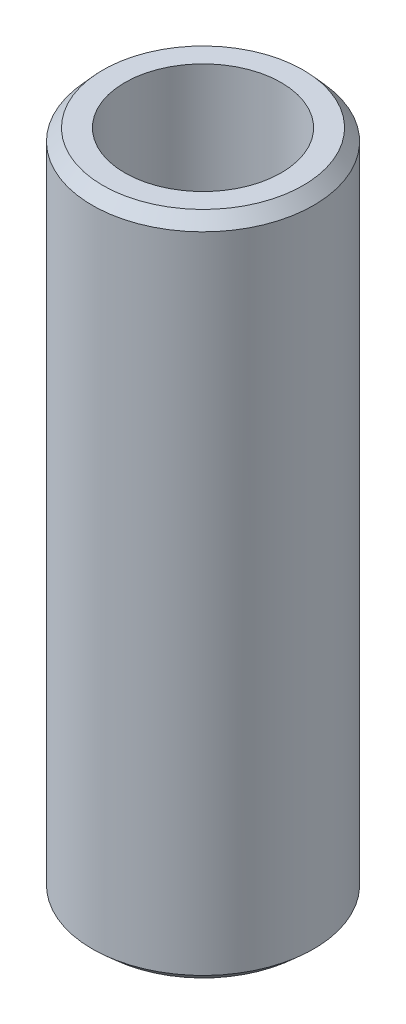
ISO-10303-21;
HEADER;
FILE_DESCRIPTION(('STEP AP214'),'2;1');
FILE_NAME('part.step','',(''),(''),'','','');
FILE_SCHEMA(('AUTOMOTIVE_DESIGN { 1 0 10303 214 1 1 1 1 }'));
ENDSEC;
DATA;
#1=APPLICATION_CONTEXT('core data for automotive mechanical design processes');
#2=APPLICATION_PROTOCOL_DEFINITION('international standard','automotive_design',2000,#1);
#3=PRODUCT_CONTEXT('',#1,'mechanical');
#4=PRODUCT('Part','Part','',(#3));
#5=PRODUCT_RELATED_PRODUCT_CATEGORY('part','',(#4));
#6=PRODUCT_DEFINITION_FORMATION('','',#4);
#7=PRODUCT_DEFINITION_CONTEXT('part definition',#1,'design');
#8=PRODUCT_DEFINITION('design','',#6,#7);
#9=PRODUCT_DEFINITION_SHAPE('','',#8);
#10=(LENGTH_UNIT() NAMED_UNIT(*) SI_UNIT(.MILLI.,.METRE.));
#11=(NAMED_UNIT(*) PLANE_ANGLE_UNIT() SI_UNIT($,.RADIAN.));
#12=(NAMED_UNIT(*) SI_UNIT($,.STERADIAN.) SOLID_ANGLE_UNIT());
#13=UNCERTAINTY_MEASURE_WITH_UNIT(LENGTH_MEASURE(1.E-05),#10,'distance_accuracy_value','');
#14=(GEOMETRIC_REPRESENTATION_CONTEXT(3) GLOBAL_UNCERTAINTY_ASSIGNED_CONTEXT((#13)) GLOBAL_UNIT_ASSIGNED_CONTEXT((#10,
#11,#12)) REPRESENTATION_CONTEXT('',''));
#15=CARTESIAN_POINT('',(0.,0.,0.));
#16=DIRECTION('',(0.,0.,1.));
#17=DIRECTION('',(1.,0.,0.));
#18=AXIS2_PLACEMENT_3D('',#15,#16,#17);
#19=CARTESIAN_POINT('',(0.,120.379519564333,0.));
#20=DIRECTION('',(0.,-1.,0.));
#21=DIRECTION('',(0.,0.,-1.));
#22=AXIS2_PLACEMENT_3D('',#19,#20,#21);
#23=CYLINDRICAL_SURFACE('',#22,20.);
#24=CARTESIAN_POINT('',(0.,118.231995027481,0.));
#25=DIRECTION('',(0.,1.,0.));
#26=DIRECTION('',(0.,0.,1.));
#27=AXIS2_PLACEMENT_3D('',#24,#25,#26);
#28=CIRCLE('',#27,20.);
#29=CARTESIAN_POINT('',(0.,118.231995027481,-20.));
#30=VERTEX_POINT('',#29);
#31=EDGE_CURVE('E50',#30,#30,#28,.F.);
#32=CARTESIAN_POINT('',(0.,1.9180633892541,0.));
#33=DIRECTION('',(0.,1.,0.));
#34=DIRECTION('',(0.,0.,1.));
#35=AXIS2_PLACEMENT_3D('',#32,#33,#34);
#36=CIRCLE('',#35,20.);
#37=CARTESIAN_POINT('',(0.,1.9180633892541,-20.));
#38=VERTEX_POINT('',#37);
#39=EDGE_CURVE('E51',#38,#38,#36,.T.);
#40=CARTESIAN_POINT('',(0.,118.231995027481,-20.));
#41=CARTESIAN_POINT('',(0.,117.020391572916,-20.));
#42=CARTESIAN_POINT('',(0.,115.808788118351,-20.));
#43=CARTESIAN_POINT('',(0.,113.385581209222,-20.));
#44=CARTESIAN_POINT('',(0.,112.173977754657,-20.));
#45=CARTESIAN_POINT('',(0.,109.750770845527,-20.));
#46=CARTESIAN_POINT('',(0.,108.539167390962,-20.));
#47=CARTESIAN_POINT('',(0.,106.115960481832,-20.));
#48=CARTESIAN_POINT('',(0.,104.904357027267,-20.));
#49=CARTESIAN_POINT('',(0.,102.481150118138,-20.));
#50=CARTESIAN_POINT('',(0.,101.269546663573,-20.));
#51=CARTESIAN_POINT('',(0.,98.8463397544432,-20.));
#52=CARTESIAN_POINT('',(0.,97.6347362998783,-20.));
#53=CARTESIAN_POINT('',(0.,95.2115293907486,-20.));
#54=CARTESIAN_POINT('',(0.,93.9999259361837,-20.));
#55=CARTESIAN_POINT('',(0.,91.576719027054,-20.));
#56=CARTESIAN_POINT('',(0.,90.3651155724891,-20.));
#57=CARTESIAN_POINT('',(0.,87.9419086633594,-20.));
#58=CARTESIAN_POINT('',(0.,86.7303052087945,-20.));
#59=CARTESIAN_POINT('',(0.,84.3070982996648,-20.));
#60=CARTESIAN_POINT('',(0.,83.0954948450999,-20.));
#61=CARTESIAN_POINT('',(0.,80.6722879359702,-20.));
#62=CARTESIAN_POINT('',(0.,79.4606844814054,-20.));
#63=CARTESIAN_POINT('',(0.,77.0374775722756,-20.));
#64=CARTESIAN_POINT('',(0.,75.8258741177108,-20.));
#65=CARTESIAN_POINT('',(0.,73.4026672085811,-20.));
#66=CARTESIAN_POINT('',(0.,72.1910637540162,-20.));
#67=CARTESIAN_POINT('',(0.,69.7678568448865,-20.));
#68=CARTESIAN_POINT('',(0.,68.5562533903216,-20.));
#69=CARTESIAN_POINT('',(0.,66.1330464811919,-20.));
#70=CARTESIAN_POINT('',(0.,64.921443026627,-20.));
#71=CARTESIAN_POINT('',(0.,62.4982361174973,-20.));
#72=CARTESIAN_POINT('',(0.,61.2866326629324,-20.));
#73=CARTESIAN_POINT('',(0.,58.8634257538027,-20.));
#74=CARTESIAN_POINT('',(0.,57.6518222992378,-20.));
#75=CARTESIAN_POINT('',(0.,55.2286153901081,-20.));
#76=CARTESIAN_POINT('',(0.,54.0170119355432,-20.));
#77=CARTESIAN_POINT('',(0.,51.5938050264135,-20.));
#78=CARTESIAN_POINT('',(0.,50.3822015718486,-20.));
#79=CARTESIAN_POINT('',(0.,47.9589946627189,-20.));
#80=CARTESIAN_POINT('',(0.,46.747391208154,-20.));
#81=CARTESIAN_POINT('',(0.,44.3241842990243,-20.));
#82=CARTESIAN_POINT('',(0.,43.1125808444595,-20.));
#83=CARTESIAN_POINT('',(0.,40.6893739353297,-20.));
#84=CARTESIAN_POINT('',(0.,39.4777704807649,-20.));
#85=CARTESIAN_POINT('',(0.,37.0545635716351,-20.));
#86=CARTESIAN_POINT('',(0.,35.8429601170703,-20.));
#87=CARTESIAN_POINT('',(0.,33.4197532079406,-20.));
#88=CARTESIAN_POINT('',(0.,32.2081497533757,-20.));
#89=CARTESIAN_POINT('',(0.,29.784942844246,-20.));
#90=CARTESIAN_POINT('',(0.,28.5733393896811,-20.));
#91=CARTESIAN_POINT('',(0.,26.1501324805514,-20.));
#92=CARTESIAN_POINT('',(0.,24.9385290259865,-20.));
#93=CARTESIAN_POINT('',(0.,22.5153221168568,-20.));
#94=CARTESIAN_POINT('',(0.,21.3037186622919,-20.));
#95=CARTESIAN_POINT('',(0.,18.8805117531622,-20.));
#96=CARTESIAN_POINT('',(0.,17.6689082985973,-20.));
#97=CARTESIAN_POINT('',(0.,15.2457013894676,-20.));
#98=CARTESIAN_POINT('',(0.,14.0340979349027,-20.));
#99=CARTESIAN_POINT('',(0.,11.610891025773,-20.));
#100=CARTESIAN_POINT('',(0.,10.3992875712081,-20.));
#101=CARTESIAN_POINT('',(0.,7.97608066207842,-20.));
#102=CARTESIAN_POINT('',(0.,6.76447720751355,-20.));
#103=CARTESIAN_POINT('',(0.,4.34127029838383,-20.));
#104=CARTESIAN_POINT('',(0.,3.12966684381896,-20.));
#105=CARTESIAN_POINT('',(0.,1.9180633892541,-20.));
#106=B_SPLINE_CURVE_WITH_KNOTS('',3,(#40,#41,#42,#43,#44,#45,#46,#47,#48,#49,#50,#51,#52,#53,
#54,#55,#56,#57,#58,#59,#60,#61,#62,#63,#64,#65,#66,#67,#68,#69,#70,#71,#72,#73,#74,#75,#76,#77,
#78,#79,#80,#81,#82,#83,#84,#85,#86,#87,#88,#89,#90,#91,#92,#93,#94,#95,#96,#97,#98,#99,#100,
#101,#102,#103,#104,#105),.UNSPECIFIED.,.F.,.F.,(4,2,2,2,2,2,2,2,2,2,2,2,2,2,2,2,2,2,2,2,2,2,2,
2,2,2,2,2,2,2,2,2,4),(0.,3.63481036369458,7.26962072738917,10.9044310910838,14.5392414547783,
18.1740518184729,21.8088621821675,25.4436725458621,29.0784829095567,32.7132932732513,
36.3481036369459,39.9829140006405,43.6177243643351,47.2525347280297,50.8873450917243,
54.5221554554188,58.1569658191134,61.791776182808,65.4265865465026,69.0613969101972,
72.6962072738918,76.3310176375864,79.965828001281,83.6006383649756,87.2354487286702,
90.8702590923647,94.5050694560593,98.1398798197539,101.774690183449,105.409500547143,
109.044310910838,112.679121274532,116.313931638227),.UNSPECIFIED.);
#107=EDGE_CURVE('BSEAM39',#30,#38,#106,.T.);
#108=ORIENTED_EDGE('',*,*,#31,.T.);
#109=ORIENTED_EDGE('',*,*,#39,.T.);
#110=ORIENTED_EDGE('',*,*,#107,.T.);
#111=ORIENTED_EDGE('',*,*,#107,.F.);
#112=EDGE_LOOP('',(#108,#110,#109,#111));
#113=FACE_BOUND('',#112,.T.);
#114=ADVANCED_FACE('F39',(#113),#23,.T.);
#115=CARTESIAN_POINT('',(0.,120.379519564333,0.));
#116=DIRECTION('',(0.,1.,0.));
#117=DIRECTION('',(0.,0.,1.));
#118=AXIS2_PLACEMENT_3D('',#115,#116,#117);
#119=PLANE('',#118);
#120=CARTESIAN_POINT('',(0.,120.379519564333,0.));
#121=DIRECTION('',(0.,1.,0.));
#122=DIRECTION('',(0.,0.,1.));
#123=AXIS2_PLACEMENT_3D('',#120,#121,#122);
#124=CIRCLE('',#123,18.081936610746);
#125=CARTESIAN_POINT('',(0.,120.379519564333,18.081936610746));
#126=VERTEX_POINT('',#125);
#127=EDGE_CURVE('E54',#126,#126,#124,.T.);
#128=ORIENTED_EDGE('',*,*,#127,.T.);
#129=EDGE_LOOP('',(#128));
#130=FACE_BOUND('',#129,.T.);
#131=CARTESIAN_POINT('',(0.,120.379519564333,0.));
#132=DIRECTION('',(0.,1.,0.));
#133=DIRECTION('',(0.,0.,1.));
#134=AXIS2_PLACEMENT_3D('',#131,#132,#133);
#135=CIRCLE('',#134,14.1313757902491);
#136=CARTESIAN_POINT('',(0.,120.379519564333,-14.1313757902491));
#137=VERTEX_POINT('',#136);
#138=EDGE_CURVE('E58',#137,#137,#135,.T.);
#139=ORIENTED_EDGE('',*,*,#138,.F.);
#140=EDGE_LOOP('',(#139));
#141=FACE_BOUND('',#140,.T.);
#142=ADVANCED_FACE('F69',(#130,#141),#119,.T.);
#143=CARTESIAN_POINT('',(0.,0.,0.));
#144=DIRECTION('',(0.,1.,0.));
#145=DIRECTION('',(0.,0.,1.));
#146=AXIS2_PLACEMENT_3D('',#143,#144,#145);
#147=PLANE('',#146);
#148=CARTESIAN_POINT('',(0.,0.,0.));
#149=DIRECTION('',(0.,1.,0.));
#150=DIRECTION('',(0.,0.,1.));
#151=AXIS2_PLACEMENT_3D('',#148,#149,#150);
#152=CIRCLE('',#151,17.8524754631481);
#153=CARTESIAN_POINT('',(0.,0.,17.8524754631481));
#154=VERTEX_POINT('',#153);
#155=EDGE_CURVE('E10',#154,#154,#152,.F.);
#156=ORIENTED_EDGE('',*,*,#155,.T.);
#157=EDGE_LOOP('',(#156));
#158=FACE_BOUND('',#157,.T.);
#159=CARTESIAN_POINT('',(0.,0.,0.));
#160=DIRECTION('',(0.,1.,0.));
#161=DIRECTION('',(0.,0.,1.));
#162=AXIS2_PLACEMENT_3D('',#159,#160,#161);
#163=CIRCLE('',#162,14.1313757902491);
#164=CARTESIAN_POINT('',(0.,0.,-14.1313757902491));
#165=VERTEX_POINT('',#164);
#166=EDGE_CURVE('E63',#165,#165,#163,.T.);
#167=ORIENTED_EDGE('',*,*,#166,.T.);
#168=EDGE_LOOP('',(#167));
#169=FACE_BOUND('',#168,.T.);
#170=ADVANCED_FACE('F75',(#158,#169),#147,.F.);
#171=CARTESIAN_POINT('',(0.,120.379519564333,0.));
#172=DIRECTION('',(0.,-1.,0.));
#173=DIRECTION('',(0.,0.,-1.));
#174=AXIS2_PLACEMENT_3D('',#171,#172,#173);
#175=CYLINDRICAL_SURFACE('',#174,14.1313757902491);
#176=CARTESIAN_POINT('',(0.,120.379519564333,-14.1313757902491));
#177=CARTESIAN_POINT('',(0.,119.125566235538,-14.1313757902491));
#178=CARTESIAN_POINT('',(0.,117.871612906742,-14.1313757902491));
#179=CARTESIAN_POINT('',(0.,115.363706249152,-14.1313757902491));
#180=CARTESIAN_POINT('',(0.,114.109752920357,-14.1313757902491));
#181=CARTESIAN_POINT('',(0.,111.601846262767,-14.1313757902491));
#182=CARTESIAN_POINT('',(0.,110.347892933972,-14.1313757902491));
#183=CARTESIAN_POINT('',(0.,107.839986276381,-14.1313757902491));
#184=CARTESIAN_POINT('',(0.,106.586032947586,-14.1313757902491));
#185=CARTESIAN_POINT('',(0.,104.078126289996,-14.1313757902491));
#186=CARTESIAN_POINT('',(0.,102.824172961201,-14.1313757902491));
#187=CARTESIAN_POINT('',(0.,100.316266303611,-14.1313757902491));
#188=CARTESIAN_POINT('',(0.,99.0623129748155,-14.1313757902491));
#189=CARTESIAN_POINT('',(0.,96.5544063172252,-14.1313757902491));
#190=CARTESIAN_POINT('',(0.,95.3004529884301,-14.1313757902491));
#191=CARTESIAN_POINT('',(0.,92.7925463308398,-14.1313757902491));
#192=CARTESIAN_POINT('',(0.,91.5385930020447,-14.1313757902491));
#193=CARTESIAN_POINT('',(0.,89.0306863444544,-14.1313757902491));
#194=CARTESIAN_POINT('',(0.,87.7767330156593,-14.1313757902491));
#195=CARTESIAN_POINT('',(0.,85.268826358069,-14.1313757902491));
#196=CARTESIAN_POINT('',(0.,84.0148730292739,-14.1313757902491));
#197=CARTESIAN_POINT('',(0.,81.5069663716836,-14.1313757902491));
#198=CARTESIAN_POINT('',(0.,80.2530130428885,-14.1313757902491));
#199=CARTESIAN_POINT('',(0.,77.7451063852982,-14.1313757902491));
#200=CARTESIAN_POINT('',(0.,76.4911530565031,-14.1313757902491));
#201=CARTESIAN_POINT('',(0.,73.9832463989128,-14.1313757902491));
#202=CARTESIAN_POINT('',(0.,72.7292930701177,-14.1313757902491));
#203=CARTESIAN_POINT('',(0.,70.2213864125274,-14.1313757902491));
#204=CARTESIAN_POINT('',(0.,68.9674330837323,-14.1313757902491));
#205=CARTESIAN_POINT('',(0.,66.459526426142,-14.1313757902491));
#206=CARTESIAN_POINT('',(0.,65.2055730973469,-14.1313757902491));
#207=CARTESIAN_POINT('',(0.,62.6976664397566,-14.1313757902491));
#208=CARTESIAN_POINT('',(0.,61.4437131109615,-14.1313757902491));
#209=CARTESIAN_POINT('',(0.,58.9358064533712,-14.1313757902491));
#210=CARTESIAN_POINT('',(0.,57.6818531245761,-14.1313757902491));
#211=CARTESIAN_POINT('',(0.,55.1739464669858,-14.1313757902491));
#212=CARTESIAN_POINT('',(0.,53.9199931381907,-14.1313757902491));
#213=CARTESIAN_POINT('',(0.,51.4120864806004,-14.1313757902491));
#214=CARTESIAN_POINT('',(0.,50.1581331518053,-14.1313757902491));
#215=CARTESIAN_POINT('',(0.,47.650226494215,-14.1313757902491));
#216=CARTESIAN_POINT('',(0.,46.3962731654199,-14.1313757902491));
#217=CARTESIAN_POINT('',(0.,43.8883665078296,-14.1313757902491));
#218=CARTESIAN_POINT('',(0.,42.6344131790345,-14.1313757902491));
#219=CARTESIAN_POINT('',(0.,40.1265065214442,-14.1313757902491));
#220=CARTESIAN_POINT('',(0.,38.8725531926491,-14.1313757902491));
#221=CARTESIAN_POINT('',(0.,36.3646465350588,-14.1313757902491));
#222=CARTESIAN_POINT('',(0.,35.1106932062637,-14.1313757902491));
#223=CARTESIAN_POINT('',(0.,32.6027865486734,-14.1313757902491));
#224=CARTESIAN_POINT('',(0.,31.3488332198783,-14.1313757902491));
#225=CARTESIAN_POINT('',(0.,28.8409265622881,-14.1313757902491));
#226=CARTESIAN_POINT('',(0.,27.5869732334929,-14.1313757902491));
#227=CARTESIAN_POINT('',(0.,25.0790665759027,-14.1313757902491));
#228=CARTESIAN_POINT('',(0.,23.8251132471075,-14.1313757902491));
#229=CARTESIAN_POINT('',(0.,21.3172065895173,-14.1313757902491));
#230=CARTESIAN_POINT('',(0.,20.0632532607221,-14.1313757902491));
#231=CARTESIAN_POINT('',(0.,17.5553466031319,-14.1313757902491));
#232=CARTESIAN_POINT('',(0.,16.3013932743367,-14.1313757902491));
#233=CARTESIAN_POINT('',(0.,13.7934866167465,-14.1313757902491));
#234=CARTESIAN_POINT('',(0.,12.5395332879513,-14.1313757902491));
#235=CARTESIAN_POINT('',(0.,10.0316266303611,-14.1313757902491));
#236=CARTESIAN_POINT('',(0.,8.77767330156592,-14.1313757902491));
#237=CARTESIAN_POINT('',(0.,6.26976664397566,-14.1313757902491));
#238=CARTESIAN_POINT('',(0.,5.01581331518053,-14.1313757902491));
#239=CARTESIAN_POINT('',(0.,2.50790665759026,-14.1313757902491));
#240=CARTESIAN_POINT('',(0.,1.25395332879513,-14.1313757902491));
#241=CARTESIAN_POINT('',(0.,0.,-14.1313757902491));
#242=B_SPLINE_CURVE_WITH_KNOTS('',3,(#176,#177,#178,#179,#180,#181,#182,#183,#184,#185,#186,
#187,#188,#189,#190,#191,#192,#193,#194,#195,#196,#197,#198,#199,#200,#201,#202,#203,#204,#205,
#206,#207,#208,#209,#210,#211,#212,#213,#214,#215,#216,#217,#218,#219,#220,#221,#222,#223,#224,
#225,#226,#227,#228,#229,#230,#231,#232,#233,#234,#235,#236,#237,#238,#239,#240,#241),
.UNSPECIFIED.,.F.,.F.,(4,2,2,2,2,2,2,2,2,2,2,2,2,2,2,2,2,2,2,2,2,2,2,2,2,2,2,2,2,2,2,2,4),(0.,
3.76185998638541,7.52371997277081,11.2855799591562,15.0474399455416,18.809299931927,
22.5711599183124,26.3330199046978,30.0948798910832,33.8567398774686,37.618599863854,
41.3804598502394,45.1423198366248,48.9041798230102,52.6660398093956,56.427899795781,
60.1897597821664,63.9516197685518,67.7134797549372,71.4753397413225,75.2371997277079,
78.9990597140933,82.7609197004788,86.5227796868641,90.2846396732495,94.0464996596349,
97.8083596460203,101.570219632406,105.332079618791,109.093939605177,112.855799591562,
116.617659577947,120.379519564333),.UNSPECIFIED.);
#243=EDGE_CURVE('BSEAM70',#137,#165,#242,.T.);
#244=ORIENTED_EDGE('',*,*,#138,.T.);
#245=ORIENTED_EDGE('',*,*,#166,.F.);
#246=ORIENTED_EDGE('',*,*,#243,.T.);
#247=ORIENTED_EDGE('',*,*,#243,.F.);
#248=EDGE_LOOP('',(#244,#246,#245,#247));
#249=FACE_BOUND('',#248,.T.);
#250=ADVANCED_FACE('F70',(#249),#175,.F.);
#251=CARTESIAN_POINT('',(0.,120.379519564333,0.));
#252=DIRECTION('',(0.,-1.,0.));
#253=DIRECTION('',(0.,0.,-1.));
#254=AXIS2_PLACEMENT_3D('',#251,#252,#253);
#255=CONICAL_SURFACE('',#254,18.081936610746,0.729018134173183);
#256=ORIENTED_EDGE('',*,*,#31,.F.);
#257=EDGE_LOOP('',(#256));
#258=FACE_BOUND('',#257,.T.);
#259=ORIENTED_EDGE('',*,*,#127,.F.);
#260=EDGE_LOOP('',(#259));
#261=FACE_BOUND('',#260,.T.);
#262=ADVANCED_FACE('F81',(#258,#261),#255,.T.);
#263=CARTESIAN_POINT('',(0.,1.9180633892541,0.));
#264=DIRECTION('',(0.,1.,0.));
#265=DIRECTION('',(0.,0.,1.));
#266=AXIS2_PLACEMENT_3D('',#263,#264,#265);
#267=CONICAL_SURFACE('',#266,20.,0.841778192621714);
#268=ORIENTED_EDGE('',*,*,#155,.F.);
#269=EDGE_LOOP('',(#268));
#270=FACE_BOUND('',#269,.T.);
#271=ORIENTED_EDGE('',*,*,#39,.F.);
#272=EDGE_LOOP('',(#271));
#273=FACE_BOUND('',#272,.T.);
#274=ADVANCED_FACE('F45',(#270,#273),#267,.T.);
#275=CLOSED_SHELL('',(#114,#142,#170,#250,#262,#274));
#276=MANIFOLD_SOLID_BREP('B2',#275);
#277=ADVANCED_BREP_SHAPE_REPRESENTATION('',(#18,#276),#14);
#278=SHAPE_DEFINITION_REPRESENTATION(#9,#277);
ENDSEC;
END-ISO-10303-21;
